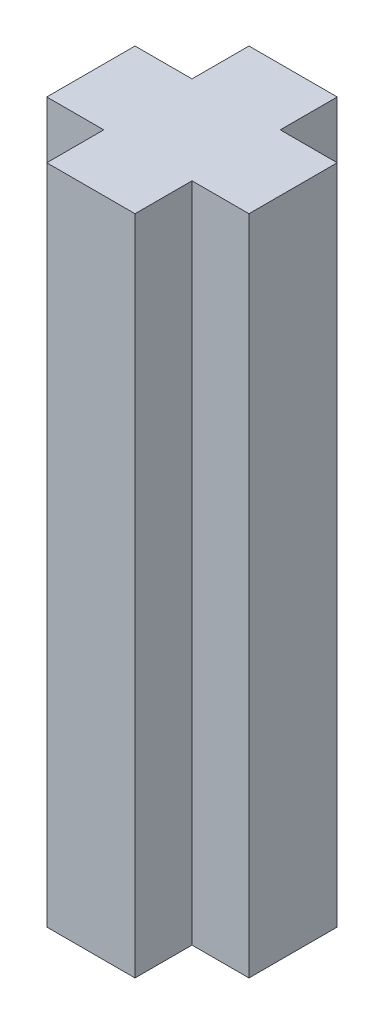
ISO-10303-21;
HEADER;
FILE_DESCRIPTION(('STEP AP214'),'2;1');
FILE_NAME('part.step','',(''),(''),'','','');
FILE_SCHEMA(('AUTOMOTIVE_DESIGN { 1 0 10303 214 1 1 1 1 }'));
ENDSEC;
DATA;
#1=APPLICATION_CONTEXT('core data for automotive mechanical design processes');
#2=APPLICATION_PROTOCOL_DEFINITION('international standard','automotive_design',2000,#1);
#3=PRODUCT_CONTEXT('',#1,'mechanical');
#4=PRODUCT('Part','Part','',(#3));
#5=PRODUCT_RELATED_PRODUCT_CATEGORY('part','',(#4));
#6=PRODUCT_DEFINITION_FORMATION('','',#4);
#7=PRODUCT_DEFINITION_CONTEXT('part definition',#1,'design');
#8=PRODUCT_DEFINITION('design','',#6,#7);
#9=PRODUCT_DEFINITION_SHAPE('','',#8);
#10=(LENGTH_UNIT() NAMED_UNIT(*) SI_UNIT(.MILLI.,.METRE.));
#11=(NAMED_UNIT(*) PLANE_ANGLE_UNIT() SI_UNIT($,.RADIAN.));
#12=(NAMED_UNIT(*) SI_UNIT($,.STERADIAN.) SOLID_ANGLE_UNIT());
#13=UNCERTAINTY_MEASURE_WITH_UNIT(LENGTH_MEASURE(1.E-05),#10,'distance_accuracy_value','');
#14=(GEOMETRIC_REPRESENTATION_CONTEXT(3) GLOBAL_UNCERTAINTY_ASSIGNED_CONTEXT((#13)) GLOBAL_UNIT_ASSIGNED_CONTEXT((#10,
#11,#12)) REPRESENTATION_CONTEXT('',''));
#15=CARTESIAN_POINT('',(0.,0.,0.));
#16=DIRECTION('',(0.,0.,1.));
#17=DIRECTION('',(1.,0.,0.));
#18=AXIS2_PLACEMENT_3D('',#15,#16,#17);
#19=CARTESIAN_POINT('',(2.28066072044439,15.,-1.0478220716509));
#20=DIRECTION('',(-1.,0.,0.));
#21=DIRECTION('',(0.,0.,1.));
#22=AXIS2_PLACEMENT_3D('',#19,#20,#21);
#23=PLANE('',#22);
#24=DIRECTION('',(0.,0.,-1.));
#25=VECTOR('',#24,1.);
#26=CARTESIAN_POINT('',(2.28066072044439,0.,-1.0478220716509));
#27=LINE('',#26,#25);
#28=CARTESIAN_POINT('',(2.28066072044438,0.,0.952177928349089));
#29=VERTEX_POINT('',#28);
#30=CARTESIAN_POINT('',(2.28066072044439,0.,-1.0478220716509));
#31=VERTEX_POINT('',#30);
#32=EDGE_CURVE('E163',#29,#31,#27,.T.);
#33=ORIENTED_EDGE('',*,*,#32,.T.);
#34=DIRECTION('',(0.,-1.,0.));
#35=VECTOR('',#34,1.);
#36=CARTESIAN_POINT('',(2.28066072044439,15.,-1.0478220716509));
#37=LINE('',#36,#35);
#38=CARTESIAN_POINT('',(2.28066072044439,15.,-1.0478220716509));
#39=VERTEX_POINT('',#38);
#40=EDGE_CURVE('E11',#39,#31,#37,.T.);
#41=ORIENTED_EDGE('',*,*,#40,.F.);
#42=DIRECTION('',(0.,0.,-1.));
#43=VECTOR('',#42,1.);
#44=CARTESIAN_POINT('',(2.28066072044439,15.,-1.0478220716509));
#45=LINE('',#44,#43);
#46=CARTESIAN_POINT('',(2.28066072044438,15.,0.952177928349089));
#47=VERTEX_POINT('',#46);
#48=EDGE_CURVE('E185',#47,#39,#45,.T.);
#49=ORIENTED_EDGE('',*,*,#48,.F.);
#50=DIRECTION('',(0.,-1.,0.));
#51=VECTOR('',#50,1.);
#52=CARTESIAN_POINT('',(2.28066072044438,15.,0.952177928349089));
#53=LINE('',#52,#51);
#54=EDGE_CURVE('E159',#47,#29,#53,.T.);
#55=ORIENTED_EDGE('',*,*,#54,.T.);
#56=EDGE_LOOP('',(#33,#41,#49,#55));
#57=FACE_BOUND('',#56,.T.);
#58=ADVANCED_FACE('F43',(#57),#23,.F.);
#59=CARTESIAN_POINT('',(0.989372872966454,15.,-1.0478220716509));
#60=DIRECTION('',(0.,0.,1.));
#61=DIRECTION('',(1.,0.,0.));
#62=AXIS2_PLACEMENT_3D('',#59,#60,#61);
#63=PLANE('',#62);
#64=DIRECTION('',(-1.,0.,0.));
#65=VECTOR('',#64,1.);
#66=CARTESIAN_POINT('',(0.989372872966454,0.,-1.0478220716509));
#67=LINE('',#66,#65);
#68=CARTESIAN_POINT('',(0.989372872966454,0.,-1.0478220716509));
#69=VERTEX_POINT('',#68);
#70=EDGE_CURVE('E166',#31,#69,#67,.T.);
#71=ORIENTED_EDGE('',*,*,#70,.T.);
#72=DIRECTION('',(0.,-1.,0.));
#73=VECTOR('',#72,1.);
#74=CARTESIAN_POINT('',(0.989372872966454,15.,-1.0478220716509));
#75=LINE('',#74,#73);
#76=CARTESIAN_POINT('',(0.989372872966454,15.,-1.0478220716509));
#77=VERTEX_POINT('',#76);
#78=EDGE_CURVE('E51',#77,#69,#75,.T.);
#79=ORIENTED_EDGE('',*,*,#78,.F.);
#80=DIRECTION('',(-1.,0.,0.));
#81=VECTOR('',#80,1.);
#82=CARTESIAN_POINT('',(0.989372872966454,15.,-1.0478220716509));
#83=LINE('',#82,#81);
#84=EDGE_CURVE('E114',#39,#77,#83,.T.);
#85=ORIENTED_EDGE('',*,*,#84,.F.);
#86=ORIENTED_EDGE('',*,*,#40,.T.);
#87=EDGE_LOOP('',(#71,#79,#85,#86));
#88=FACE_BOUND('',#87,.T.);
#89=ADVANCED_FACE('F263',(#88),#63,.F.);
#90=CARTESIAN_POINT('',(0.989372872966454,15.,-2.33910991912884));
#91=DIRECTION('',(-1.,0.,0.));
#92=DIRECTION('',(0.,0.,1.));
#93=AXIS2_PLACEMENT_3D('',#90,#91,#92);
#94=PLANE('',#93);
#95=DIRECTION('',(0.,0.,-1.));
#96=VECTOR('',#95,1.);
#97=CARTESIAN_POINT('',(0.989372872966454,0.,-2.33910991912884));
#98=LINE('',#97,#96);
#99=CARTESIAN_POINT('',(0.989372872966454,0.,-2.33910991912884));
#100=VERTEX_POINT('',#99);
#101=EDGE_CURVE('E168',#69,#100,#98,.T.);
#102=ORIENTED_EDGE('',*,*,#101,.T.);
#103=DIRECTION('',(0.,-1.,0.));
#104=VECTOR('',#103,1.);
#105=CARTESIAN_POINT('',(0.989372872966454,15.,-2.33910991912884));
#106=LINE('',#105,#104);
#107=CARTESIAN_POINT('',(0.989372872966454,15.,-2.33910991912884));
#108=VERTEX_POINT('',#107);
#109=EDGE_CURVE('E204',#108,#100,#106,.T.);
#110=ORIENTED_EDGE('',*,*,#109,.F.);
#111=DIRECTION('',(0.,0.,-1.));
#112=VECTOR('',#111,1.);
#113=CARTESIAN_POINT('',(0.989372872966454,15.,-2.33910991912884));
#114=LINE('',#113,#112);
#115=EDGE_CURVE('E212',#77,#108,#114,.T.);
#116=ORIENTED_EDGE('',*,*,#115,.F.);
#117=ORIENTED_EDGE('',*,*,#78,.T.);
#118=EDGE_LOOP('',(#102,#110,#116,#117));
#119=FACE_BOUND('',#118,.T.);
#120=ADVANCED_FACE('F210',(#119),#94,.F.);
#121=CARTESIAN_POINT('',(-1.01062712703353,15.,-2.33910991912884));
#122=DIRECTION('',(0.,0.,1.));
#123=DIRECTION('',(1.,0.,0.));
#124=AXIS2_PLACEMENT_3D('',#121,#122,#123);
#125=PLANE('',#124);
#126=DIRECTION('',(-1.,0.,0.));
#127=VECTOR('',#126,1.);
#128=CARTESIAN_POINT('',(-1.01062712703353,0.,-2.33910991912884));
#129=LINE('',#128,#127);
#130=CARTESIAN_POINT('',(-1.01062712703353,0.,-2.33910991912884));
#131=VERTEX_POINT('',#130);
#132=EDGE_CURVE('E170',#100,#131,#129,.T.);
#133=ORIENTED_EDGE('',*,*,#132,.T.);
#134=DIRECTION('',(0.,-1.,0.));
#135=VECTOR('',#134,1.);
#136=CARTESIAN_POINT('',(-1.01062712703353,15.,-2.33910991912884));
#137=LINE('',#136,#135);
#138=CARTESIAN_POINT('',(-1.01062712703353,15.,-2.33910991912884));
#139=VERTEX_POINT('',#138);
#140=EDGE_CURVE('E201',#139,#131,#137,.T.);
#141=ORIENTED_EDGE('',*,*,#140,.F.);
#142=DIRECTION('',(-1.,0.,0.));
#143=VECTOR('',#142,1.);
#144=CARTESIAN_POINT('',(-1.01062712703353,15.,-2.33910991912884));
#145=LINE('',#144,#143);
#146=EDGE_CURVE('E230',#108,#139,#145,.T.);
#147=ORIENTED_EDGE('',*,*,#146,.F.);
#148=ORIENTED_EDGE('',*,*,#109,.T.);
#149=EDGE_LOOP('',(#133,#141,#147,#148));
#150=FACE_BOUND('',#149,.T.);
#151=ADVANCED_FACE('F221',(#150),#125,.F.);
#152=CARTESIAN_POINT('',(-1.01062712703353,15.,-1.04782207165091));
#153=DIRECTION('',(1.,0.,0.));
#154=DIRECTION('',(0.,0.,-1.));
#155=AXIS2_PLACEMENT_3D('',#152,#153,#154);
#156=PLANE('',#155);
#157=DIRECTION('',(0.,0.,1.));
#158=VECTOR('',#157,1.);
#159=CARTESIAN_POINT('',(-1.01062712703353,0.,-1.04782207165091));
#160=LINE('',#159,#158);
#161=CARTESIAN_POINT('',(-1.01062712703353,0.,-1.04782207165091));
#162=VERTEX_POINT('',#161);
#163=EDGE_CURVE('E172',#131,#162,#160,.T.);
#164=ORIENTED_EDGE('',*,*,#163,.T.);
#165=DIRECTION('',(0.,-1.,0.));
#166=VECTOR('',#165,1.);
#167=CARTESIAN_POINT('',(-1.01062712703353,15.,-1.04782207165091));
#168=LINE('',#167,#166);
#169=CARTESIAN_POINT('',(-1.01062712703353,15.,-1.04782207165091));
#170=VERTEX_POINT('',#169);
#171=EDGE_CURVE('E198',#170,#162,#168,.T.);
#172=ORIENTED_EDGE('',*,*,#171,.F.);
#173=DIRECTION('',(0.,0.,1.));
#174=VECTOR('',#173,1.);
#175=CARTESIAN_POINT('',(-1.01062712703353,15.,-1.04782207165091));
#176=LINE('',#175,#174);
#177=EDGE_CURVE('E227',#139,#170,#176,.T.);
#178=ORIENTED_EDGE('',*,*,#177,.F.);
#179=ORIENTED_EDGE('',*,*,#140,.T.);
#180=EDGE_LOOP('',(#164,#172,#178,#179));
#181=FACE_BOUND('',#180,.T.);
#182=ADVANCED_FACE('F225',(#181),#156,.F.);
#183=CARTESIAN_POINT('',(-2.30191497451146,15.,-1.04782207165091));
#184=DIRECTION('',(0.,0.,1.));
#185=DIRECTION('',(1.,0.,0.));
#186=AXIS2_PLACEMENT_3D('',#183,#184,#185);
#187=PLANE('',#186);
#188=DIRECTION('',(-1.,0.,0.));
#189=VECTOR('',#188,1.);
#190=CARTESIAN_POINT('',(-2.30191497451146,0.,-1.04782207165091));
#191=LINE('',#190,#189);
#192=CARTESIAN_POINT('',(-2.30191497451146,0.,-1.04782207165091));
#193=VERTEX_POINT('',#192);
#194=EDGE_CURVE('E174',#162,#193,#191,.T.);
#195=ORIENTED_EDGE('',*,*,#194,.T.);
#196=DIRECTION('',(0.,-1.,0.));
#197=VECTOR('',#196,1.);
#198=CARTESIAN_POINT('',(-2.30191497451146,15.,-1.04782207165091));
#199=LINE('',#198,#197);
#200=CARTESIAN_POINT('',(-2.30191497451146,15.,-1.04782207165091));
#201=VERTEX_POINT('',#200);
#202=EDGE_CURVE('E195',#201,#193,#199,.T.);
#203=ORIENTED_EDGE('',*,*,#202,.F.);
#204=DIRECTION('',(-1.,0.,0.));
#205=VECTOR('',#204,1.);
#206=CARTESIAN_POINT('',(-2.30191497451146,15.,-1.04782207165091));
#207=LINE('',#206,#205);
#208=EDGE_CURVE('E229',#170,#201,#207,.T.);
#209=ORIENTED_EDGE('',*,*,#208,.F.);
#210=ORIENTED_EDGE('',*,*,#171,.T.);
#211=EDGE_LOOP('',(#195,#203,#209,#210));
#212=FACE_BOUND('',#211,.T.);
#213=ADVANCED_FACE('F276',(#212),#187,.F.);
#214=CARTESIAN_POINT('',(-2.30191497451146,15.,0.952177928349075));
#215=DIRECTION('',(1.,0.,0.));
#216=DIRECTION('',(0.,0.,-1.));
#217=AXIS2_PLACEMENT_3D('',#214,#215,#216);
#218=PLANE('',#217);
#219=DIRECTION('',(0.,0.,1.));
#220=VECTOR('',#219,1.);
#221=CARTESIAN_POINT('',(-2.30191497451146,0.,0.952177928349075));
#222=LINE('',#221,#220);
#223=CARTESIAN_POINT('',(-2.30191497451146,0.,0.952177928349075));
#224=VERTEX_POINT('',#223);
#225=EDGE_CURVE('E176',#193,#224,#222,.T.);
#226=ORIENTED_EDGE('',*,*,#225,.T.);
#227=DIRECTION('',(0.,-1.,0.));
#228=VECTOR('',#227,1.);
#229=CARTESIAN_POINT('',(-2.30191497451146,15.,0.952177928349075));
#230=LINE('',#229,#228);
#231=CARTESIAN_POINT('',(-2.30191497451146,15.,0.952177928349075));
#232=VERTEX_POINT('',#231);
#233=EDGE_CURVE('E192',#232,#224,#230,.T.);
#234=ORIENTED_EDGE('',*,*,#233,.F.);
#235=DIRECTION('',(0.,0.,1.));
#236=VECTOR('',#235,1.);
#237=CARTESIAN_POINT('',(-2.30191497451146,15.,0.952177928349075));
#238=LINE('',#237,#236);
#239=EDGE_CURVE('E232',#201,#232,#238,.T.);
#240=ORIENTED_EDGE('',*,*,#239,.F.);
#241=ORIENTED_EDGE('',*,*,#202,.T.);
#242=EDGE_LOOP('',(#226,#234,#240,#241));
#243=FACE_BOUND('',#242,.T.);
#244=ADVANCED_FACE('F279',(#243),#218,.F.);
#245=CARTESIAN_POINT('',(-1.01062712703353,15.,0.952177928349075));
#246=DIRECTION('',(0.,0.,-1.));
#247=DIRECTION('',(-1.,0.,0.));
#248=AXIS2_PLACEMENT_3D('',#245,#246,#247);
#249=PLANE('',#248);
#250=DIRECTION('',(1.,0.,0.));
#251=VECTOR('',#250,1.);
#252=CARTESIAN_POINT('',(-1.01062712703353,0.,0.952177928349075));
#253=LINE('',#252,#251);
#254=CARTESIAN_POINT('',(-1.01062712703353,0.,0.952177928349075));
#255=VERTEX_POINT('',#254);
#256=EDGE_CURVE('E178',#224,#255,#253,.T.);
#257=ORIENTED_EDGE('',*,*,#256,.T.);
#258=DIRECTION('',(0.,-1.,0.));
#259=VECTOR('',#258,1.);
#260=CARTESIAN_POINT('',(-1.01062712703353,15.,0.952177928349075));
#261=LINE('',#260,#259);
#262=CARTESIAN_POINT('',(-1.01062712703353,15.,0.952177928349075));
#263=VERTEX_POINT('',#262);
#264=EDGE_CURVE('E189',#263,#255,#261,.T.);
#265=ORIENTED_EDGE('',*,*,#264,.F.);
#266=DIRECTION('',(1.,0.,0.));
#267=VECTOR('',#266,1.);
#268=CARTESIAN_POINT('',(-1.01062712703353,15.,0.952177928349075));
#269=LINE('',#268,#267);
#270=EDGE_CURVE('E238',#232,#263,#269,.T.);
#271=ORIENTED_EDGE('',*,*,#270,.F.);
#272=ORIENTED_EDGE('',*,*,#233,.T.);
#273=EDGE_LOOP('',(#257,#265,#271,#272));
#274=FACE_BOUND('',#273,.T.);
#275=ADVANCED_FACE('F244',(#274),#249,.F.);
#276=CARTESIAN_POINT('',(-1.01062712703353,15.,2.243465775827));
#277=DIRECTION('',(1.,0.,0.));
#278=DIRECTION('',(0.,0.,-1.));
#279=AXIS2_PLACEMENT_3D('',#276,#277,#278);
#280=PLANE('',#279);
#281=DIRECTION('',(0.,0.,1.));
#282=VECTOR('',#281,1.);
#283=CARTESIAN_POINT('',(-1.01062712703353,0.,2.243465775827));
#284=LINE('',#283,#282);
#285=CARTESIAN_POINT('',(-1.01062712703353,0.,2.243465775827));
#286=VERTEX_POINT('',#285);
#287=EDGE_CURVE('E180',#255,#286,#284,.T.);
#288=ORIENTED_EDGE('',*,*,#287,.T.);
#289=DIRECTION('',(0.,-1.,0.));
#290=VECTOR('',#289,1.);
#291=CARTESIAN_POINT('',(-1.01062712703353,15.,2.243465775827));
#292=LINE('',#291,#290);
#293=CARTESIAN_POINT('',(-1.01062712703353,15.,2.243465775827));
#294=VERTEX_POINT('',#293);
#295=EDGE_CURVE('E154',#294,#286,#292,.T.);
#296=ORIENTED_EDGE('',*,*,#295,.F.);
#297=DIRECTION('',(0.,0.,1.));
#298=VECTOR('',#297,1.);
#299=CARTESIAN_POINT('',(-1.01062712703353,15.,2.243465775827));
#300=LINE('',#299,#298);
#301=EDGE_CURVE('E145',#263,#294,#300,.T.);
#302=ORIENTED_EDGE('',*,*,#301,.F.);
#303=ORIENTED_EDGE('',*,*,#264,.T.);
#304=EDGE_LOOP('',(#288,#296,#302,#303));
#305=FACE_BOUND('',#304,.T.);
#306=ADVANCED_FACE('F248',(#305),#280,.F.);
#307=CARTESIAN_POINT('',(0.989372872966454,15.,2.243465775827));
#308=DIRECTION('',(0.,0.,-1.));
#309=DIRECTION('',(-1.,0.,0.));
#310=AXIS2_PLACEMENT_3D('',#307,#308,#309);
#311=PLANE('',#310);
#312=DIRECTION('',(1.,0.,0.));
#313=VECTOR('',#312,1.);
#314=CARTESIAN_POINT('',(0.989372872966454,0.,2.243465775827));
#315=LINE('',#314,#313);
#316=CARTESIAN_POINT('',(0.989372872966454,0.,2.243465775827));
#317=VERTEX_POINT('',#316);
#318=EDGE_CURVE('E153',#286,#317,#315,.T.);
#319=ORIENTED_EDGE('',*,*,#318,.T.);
#320=DIRECTION('',(0.,-1.,0.));
#321=VECTOR('',#320,1.);
#322=CARTESIAN_POINT('',(0.989372872966454,15.,2.243465775827));
#323=LINE('',#322,#321);
#324=CARTESIAN_POINT('',(0.989372872966454,15.,2.243465775827));
#325=VERTEX_POINT('',#324);
#326=EDGE_CURVE('E150',#325,#317,#323,.T.);
#327=ORIENTED_EDGE('',*,*,#326,.F.);
#328=DIRECTION('',(1.,0.,0.));
#329=VECTOR('',#328,1.);
#330=CARTESIAN_POINT('',(0.989372872966454,15.,2.243465775827));
#331=LINE('',#330,#329);
#332=EDGE_CURVE('E139',#294,#325,#331,.T.);
#333=ORIENTED_EDGE('',*,*,#332,.F.);
#334=ORIENTED_EDGE('',*,*,#295,.T.);
#335=EDGE_LOOP('',(#319,#327,#333,#334));
#336=FACE_BOUND('',#335,.T.);
#337=ADVANCED_FACE('F151',(#336),#311,.F.);
#338=CARTESIAN_POINT('',(0.989372872966454,15.,0.952177928349089));
#339=DIRECTION('',(-1.,0.,0.));
#340=DIRECTION('',(0.,0.,1.));
#341=AXIS2_PLACEMENT_3D('',#338,#339,#340);
#342=PLANE('',#341);
#343=DIRECTION('',(0.,0.,-1.));
#344=VECTOR('',#343,1.);
#345=CARTESIAN_POINT('',(0.989372872966454,0.,0.952177928349089));
#346=LINE('',#345,#344);
#347=CARTESIAN_POINT('',(0.989372872966454,0.,0.952177928349089));
#348=VERTEX_POINT('',#347);
#349=EDGE_CURVE('E100',#317,#348,#346,.T.);
#350=ORIENTED_EDGE('',*,*,#349,.T.);
#351=DIRECTION('',(0.,-1.,0.));
#352=VECTOR('',#351,1.);
#353=CARTESIAN_POINT('',(0.989372872966454,15.,0.952177928349089));
#354=LINE('',#353,#352);
#355=CARTESIAN_POINT('',(0.989372872966454,15.,0.952177928349089));
#356=VERTEX_POINT('',#355);
#357=EDGE_CURVE('E155',#356,#348,#354,.T.);
#358=ORIENTED_EDGE('',*,*,#357,.F.);
#359=DIRECTION('',(0.,0.,-1.));
#360=VECTOR('',#359,1.);
#361=CARTESIAN_POINT('',(0.989372872966454,15.,0.952177928349089));
#362=LINE('',#361,#360);
#363=EDGE_CURVE('E143',#325,#356,#362,.T.);
#364=ORIENTED_EDGE('',*,*,#363,.F.);
#365=ORIENTED_EDGE('',*,*,#326,.T.);
#366=EDGE_LOOP('',(#350,#358,#364,#365));
#367=FACE_BOUND('',#366,.T.);
#368=ADVANCED_FACE('F157',(#367),#342,.F.);
#369=CARTESIAN_POINT('',(2.28066072044438,15.,0.952177928349089));
#370=DIRECTION('',(0.,0.,-1.));
#371=DIRECTION('',(-1.,0.,0.));
#372=AXIS2_PLACEMENT_3D('',#369,#370,#371);
#373=PLANE('',#372);
#374=DIRECTION('',(1.,0.,0.));
#375=VECTOR('',#374,1.);
#376=CARTESIAN_POINT('',(2.28066072044438,0.,0.952177928349089));
#377=LINE('',#376,#375);
#378=EDGE_CURVE('E106',#348,#29,#377,.T.);
#379=ORIENTED_EDGE('',*,*,#378,.T.);
#380=ORIENTED_EDGE('',*,*,#54,.F.);
#381=DIRECTION('',(1.,0.,0.));
#382=VECTOR('',#381,1.);
#383=CARTESIAN_POINT('',(2.28066072044438,15.,0.952177928349089));
#384=LINE('',#383,#382);
#385=EDGE_CURVE('E59',#356,#47,#384,.T.);
#386=ORIENTED_EDGE('',*,*,#385,.F.);
#387=ORIENTED_EDGE('',*,*,#357,.T.);
#388=EDGE_LOOP('',(#379,#380,#386,#387));
#389=FACE_BOUND('',#388,.T.);
#390=ADVANCED_FACE('F252',(#389),#373,.F.);
#391=CARTESIAN_POINT('',(0.,15.,0.));
#392=DIRECTION('',(0.,-1.,0.));
#393=DIRECTION('',(0.,0.,-1.));
#394=AXIS2_PLACEMENT_3D('',#391,#392,#393);
#395=PLANE('',#394);
#396=ORIENTED_EDGE('',*,*,#48,.T.);
#397=ORIENTED_EDGE('',*,*,#84,.T.);
#398=ORIENTED_EDGE('',*,*,#115,.T.);
#399=ORIENTED_EDGE('',*,*,#146,.T.);
#400=ORIENTED_EDGE('',*,*,#177,.T.);
#401=ORIENTED_EDGE('',*,*,#208,.T.);
#402=ORIENTED_EDGE('',*,*,#239,.T.);
#403=ORIENTED_EDGE('',*,*,#270,.T.);
#404=ORIENTED_EDGE('',*,*,#301,.T.);
#405=ORIENTED_EDGE('',*,*,#332,.T.);
#406=ORIENTED_EDGE('',*,*,#363,.T.);
#407=ORIENTED_EDGE('',*,*,#385,.T.);
#408=EDGE_LOOP('',(#396,#397,#398,#399,#400,#401,#402,#403,#404,#405,#406,#407));
#409=FACE_BOUND('',#408,.T.);
#410=ADVANCED_FACE('F141',(#409),#395,.F.);
#411=CARTESIAN_POINT('',(0.,0.,0.));
#412=DIRECTION('',(0.,-1.,0.));
#413=DIRECTION('',(0.,0.,-1.));
#414=AXIS2_PLACEMENT_3D('',#411,#412,#413);
#415=PLANE('',#414);
#416=ORIENTED_EDGE('',*,*,#32,.F.);
#417=ORIENTED_EDGE('',*,*,#378,.F.);
#418=ORIENTED_EDGE('',*,*,#349,.F.);
#419=ORIENTED_EDGE('',*,*,#318,.F.);
#420=ORIENTED_EDGE('',*,*,#287,.F.);
#421=ORIENTED_EDGE('',*,*,#256,.F.);
#422=ORIENTED_EDGE('',*,*,#225,.F.);
#423=ORIENTED_EDGE('',*,*,#194,.F.);
#424=ORIENTED_EDGE('',*,*,#163,.F.);
#425=ORIENTED_EDGE('',*,*,#132,.F.);
#426=ORIENTED_EDGE('',*,*,#101,.F.);
#427=ORIENTED_EDGE('',*,*,#70,.F.);
#428=EDGE_LOOP('',(#416,#417,#418,#419,#420,#421,#422,#423,#424,#425,#426,#427));
#429=FACE_BOUND('',#428,.T.);
#430=ADVANCED_FACE('F216',(#429),#415,.T.);
#431=CLOSED_SHELL('',(#58,#89,#120,#151,#182,#213,#244,#275,#306,#337,#368,#390,#410,#430));
#432=MANIFOLD_SOLID_BREP('B2',#431);
#433=ADVANCED_BREP_SHAPE_REPRESENTATION('',(#18,#432),#14);
#434=SHAPE_DEFINITION_REPRESENTATION(#9,#433);
ENDSEC;
END-ISO-10303-21;
